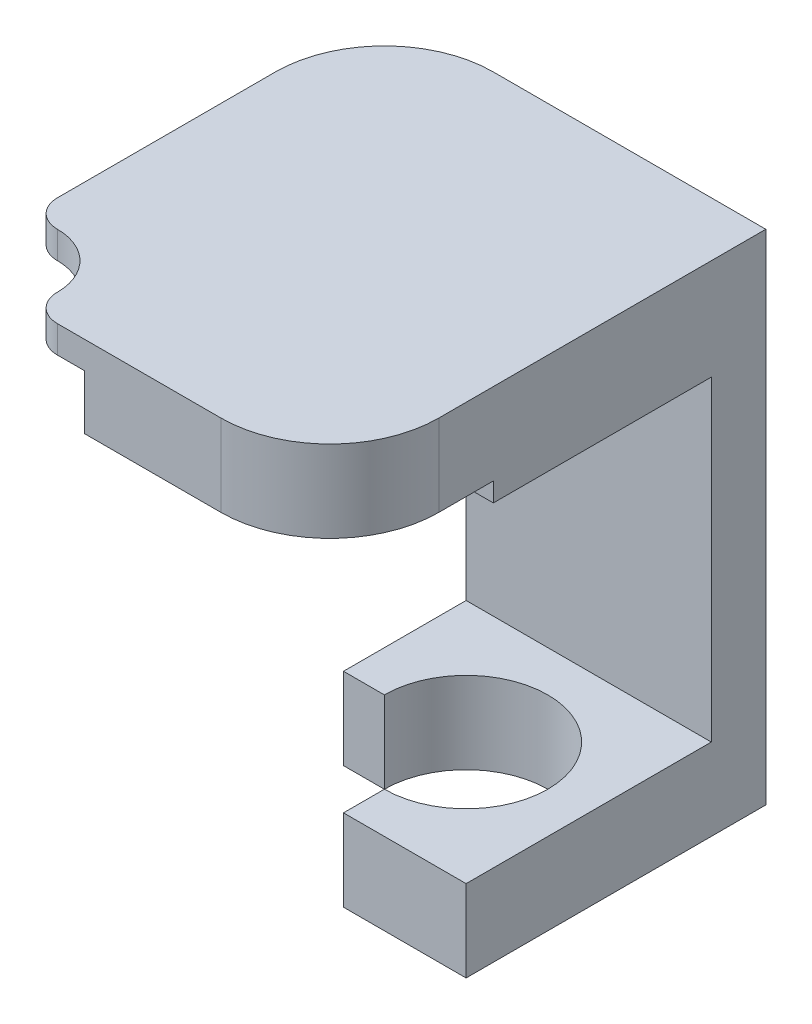
ISO-10303-21;
HEADER;
FILE_DESCRIPTION(('STEP AP214'),'2;1');
FILE_NAME('part.step','',(''),(''),'','','');
FILE_SCHEMA(('AUTOMOTIVE_DESIGN { 1 0 10303 214 1 1 1 1 }'));
ENDSEC;
DATA;
#1=APPLICATION_CONTEXT('core data for automotive mechanical design processes');
#2=APPLICATION_PROTOCOL_DEFINITION('international standard','automotive_design',2000,#1);
#3=PRODUCT_CONTEXT('',#1,'mechanical');
#4=PRODUCT('Part','Part','',(#3));
#5=PRODUCT_RELATED_PRODUCT_CATEGORY('part','',(#4));
#6=PRODUCT_DEFINITION_FORMATION('','',#4);
#7=PRODUCT_DEFINITION_CONTEXT('part definition',#1,'design');
#8=PRODUCT_DEFINITION('design','',#6,#7);
#9=PRODUCT_DEFINITION_SHAPE('','',#8);
#10=(LENGTH_UNIT() NAMED_UNIT(*) SI_UNIT(.MILLI.,.METRE.));
#11=(NAMED_UNIT(*) PLANE_ANGLE_UNIT() SI_UNIT($,.RADIAN.));
#12=(NAMED_UNIT(*) SI_UNIT($,.STERADIAN.) SOLID_ANGLE_UNIT());
#13=UNCERTAINTY_MEASURE_WITH_UNIT(LENGTH_MEASURE(1.E-05),#10,'distance_accuracy_value','');
#14=(GEOMETRIC_REPRESENTATION_CONTEXT(3) GLOBAL_UNCERTAINTY_ASSIGNED_CONTEXT((#13)) GLOBAL_UNIT_ASSIGNED_CONTEXT((#10,
#11,#12)) REPRESENTATION_CONTEXT('',''));
#15=CARTESIAN_POINT('',(0.,0.,0.));
#16=DIRECTION('',(0.,0.,1.));
#17=DIRECTION('',(1.,0.,0.));
#18=AXIS2_PLACEMENT_3D('',#15,#16,#17);
#19=CARTESIAN_POINT('',(0.,0.,5.28410471378163));
#20=DIRECTION('',(0.,0.,1.));
#21=DIRECTION('',(-1.,0.,0.));
#22=AXIS2_PLACEMENT_3D('',#19,#20,#21);
#23=PLANE('',#22);
#24=DIRECTION('',(0.,-1.,0.));
#25=VECTOR('',#24,1.);
#26=CARTESIAN_POINT('',(-13.3528439453228,-3.,5.28410471378163));
#27=LINE('',#26,#25);
#28=CARTESIAN_POINT('',(-13.3528439453228,11.5999999999993,5.28410471378163));
#29=VERTEX_POINT('',#28);
#30=CARTESIAN_POINT('',(-13.3528439453228,0.,5.28410471378163));
#31=VERTEX_POINT('',#30);
#32=EDGE_CURVE('E234',#29,#31,#27,.T.);
#33=ORIENTED_EDGE('',*,*,#32,.T.);
#34=DIRECTION('',(1.,0.,0.));
#35=VECTOR('',#34,1.);
#36=CARTESIAN_POINT('',(-13.3528439453228,0.,5.28410471378163));
#37=LINE('',#36,#35);
#38=CARTESIAN_POINT('',(-4.35284394532278,0.,5.28410471378163));
#39=VERTEX_POINT('',#38);
#40=EDGE_CURVE('E450',#31,#39,#37,.T.);
#41=ORIENTED_EDGE('',*,*,#40,.T.);
#42=DIRECTION('',(0.,1.,0.));
#43=VECTOR('',#42,1.);
#44=CARTESIAN_POINT('',(-4.35284394532278,-3.,5.28410471378163));
#45=LINE('',#44,#43);
#46=CARTESIAN_POINT('',(-4.35284394532278,11.5999999999993,5.28410471378163));
#47=VERTEX_POINT('',#46);
#48=EDGE_CURVE('E239',#39,#47,#45,.T.);
#49=ORIENTED_EDGE('',*,*,#48,.T.);
#50=DIRECTION('',(-1.,0.,0.));
#51=VECTOR('',#50,1.);
#52=CARTESIAN_POINT('',(-4.35284394532278,11.5999999999993,5.28410471378163));
#53=LINE('',#52,#51);
#54=EDGE_CURVE('E209',#47,#29,#53,.T.);
#55=ORIENTED_EDGE('',*,*,#54,.T.);
#56=EDGE_LOOP('',(#33,#41,#49,#55));
#57=FACE_BOUND('',#56,.T.);
#58=ADVANCED_FACE('F35',(#57),#23,.T.);
#59=CARTESIAN_POINT('',(-4.35284394532278,-3.,14.2841047137816));
#60=DIRECTION('',(1.,0.,0.));
#61=DIRECTION('',(0.,0.,1.));
#62=AXIS2_PLACEMENT_3D('',#59,#60,#61);
#63=PLANE('',#62);
#64=DIRECTION('',(0.,0.,1.));
#65=VECTOR('',#64,1.);
#66=CARTESIAN_POINT('',(-4.35284394532278,12.3,19.2841047137816));
#67=LINE('',#66,#65);
#68=CARTESIAN_POINT('',(-4.35284394532278,12.3,13.2841047137816));
#69=VERTEX_POINT('',#68);
#70=CARTESIAN_POINT('',(-4.35284394532278,12.3,15.2841047137816));
#71=VERTEX_POINT('',#70);
#72=EDGE_CURVE('E321',#69,#71,#67,.T.);
#73=ORIENTED_EDGE('',*,*,#72,.F.);
#74=DIRECTION('',(0.,-1.,0.));
#75=VECTOR('',#74,1.);
#76=CARTESIAN_POINT('',(-4.35284394532278,15.3,13.2841047137816));
#77=LINE('',#76,#75);
#78=CARTESIAN_POINT('',(-4.35284394532278,11.5999999999993,13.2841047137816));
#79=VERTEX_POINT('',#78);
#80=EDGE_CURVE('E220',#69,#79,#77,.T.);
#81=ORIENTED_EDGE('',*,*,#80,.T.);
#82=DIRECTION('',(0.,0.,-1.));
#83=VECTOR('',#82,1.);
#84=CARTESIAN_POINT('',(-4.35284394532278,11.5999999999993,13.2841047137816));
#85=LINE('',#84,#83);
#86=EDGE_CURVE('E232',#79,#47,#85,.T.);
#87=ORIENTED_EDGE('',*,*,#86,.T.);
#88=ORIENTED_EDGE('',*,*,#48,.F.);
#89=DIRECTION('',(0.,0.,1.));
#90=VECTOR('',#89,1.);
#91=CARTESIAN_POINT('',(-4.35284394532278,0.,14.2841047137816));
#92=LINE('',#91,#90);
#93=CARTESIAN_POINT('',(-4.35284394532278,0.,14.2841047137816));
#94=VERTEX_POINT('',#93);
#95=EDGE_CURVE('E473',#39,#94,#92,.T.);
#96=ORIENTED_EDGE('',*,*,#95,.T.);
#97=DIRECTION('',(0.,1.,0.));
#98=VECTOR('',#97,1.);
#99=CARTESIAN_POINT('',(-4.35284394532278,-3.,14.2841047137816));
#100=LINE('',#99,#98);
#101=CARTESIAN_POINT('',(-4.35284394532278,-3.,14.2841047137816));
#102=VERTEX_POINT('',#101);
#103=EDGE_CURVE('E261',#102,#94,#100,.T.);
#104=ORIENTED_EDGE('',*,*,#103,.F.);
#105=DIRECTION('',(0.,0.,1.));
#106=VECTOR('',#105,1.);
#107=CARTESIAN_POINT('',(-4.35284394532278,-3.,14.2841047137816));
#108=LINE('',#107,#106);
#109=CARTESIAN_POINT('',(-4.35284394532278,-3.,3.28410471378163));
#110=VERTEX_POINT('',#109);
#111=EDGE_CURVE('E481',#110,#102,#108,.T.);
#112=ORIENTED_EDGE('',*,*,#111,.F.);
#113=DIRECTION('',(0.,1.,0.));
#114=VECTOR('',#113,1.);
#115=CARTESIAN_POINT('',(-4.35284394532278,-3.,3.28410471378163));
#116=LINE('',#115,#114);
#117=CARTESIAN_POINT('',(-4.35284394532278,15.3,3.28410471378163));
#118=VERTEX_POINT('',#117);
#119=EDGE_CURVE('E241',#110,#118,#116,.T.);
#120=ORIENTED_EDGE('',*,*,#119,.T.);
#121=DIRECTION('',(0.,0.,1.));
#122=VECTOR('',#121,1.);
#123=CARTESIAN_POINT('',(-4.35284394532278,15.3,3.28410471378163));
#124=LINE('',#123,#122);
#125=CARTESIAN_POINT('',(-4.35284394532278,15.3,15.2841047137816));
#126=VERTEX_POINT('',#125);
#127=EDGE_CURVE('E247',#118,#126,#124,.T.);
#128=ORIENTED_EDGE('',*,*,#127,.T.);
#129=DIRECTION('',(0.,1.,0.));
#130=VECTOR('',#129,1.);
#131=CARTESIAN_POINT('',(-4.35284394532278,-3.,15.2841047137816));
#132=LINE('',#131,#130);
#133=EDGE_CURVE('E260',#71,#126,#132,.T.);
#134=ORIENTED_EDGE('',*,*,#133,.F.);
#135=EDGE_LOOP('',(#73,#81,#87,#88,#96,#104,#112,#120,#128,#134));
#136=FACE_BOUND('',#135,.T.);
#137=ADVANCED_FACE('F357',(#136),#63,.T.);
#138=CARTESIAN_POINT('',(-13.3528439453228,-3.,14.2841047137816));
#139=DIRECTION('',(-1.,0.,0.));
#140=DIRECTION('',(0.,0.,-1.));
#141=AXIS2_PLACEMENT_3D('',#138,#139,#140);
#142=PLANE('',#141);
#143=DIRECTION('',(0.,0.,-1.));
#144=VECTOR('',#143,1.);
#145=CARTESIAN_POINT('',(-13.3528439453228,12.3,14.2841047137816));
#146=LINE('',#145,#144);
#147=CARTESIAN_POINT('',(-13.3528439453228,12.3,13.2841047137816));
#148=VERTEX_POINT('',#147);
#149=CARTESIAN_POINT('',(-13.3528439453228,12.3,3.28410471378163));
#150=VERTEX_POINT('',#149);
#151=EDGE_CURVE('E206',#148,#150,#146,.T.);
#152=ORIENTED_EDGE('',*,*,#151,.T.);
#153=DIRECTION('',(0.,-1.,0.));
#154=VECTOR('',#153,1.);
#155=CARTESIAN_POINT('',(-13.3528439453228,-3.,3.28410471378163));
#156=LINE('',#155,#154);
#157=CARTESIAN_POINT('',(-13.3528439453228,-3.,3.28410471378163));
#158=VERTEX_POINT('',#157);
#159=EDGE_CURVE('E235',#150,#158,#156,.T.);
#160=ORIENTED_EDGE('',*,*,#159,.T.);
#161=DIRECTION('',(0.,0.,-1.));
#162=VECTOR('',#161,1.);
#163=CARTESIAN_POINT('',(-13.3528439453228,-3.,14.2841047137816));
#164=LINE('',#163,#162);
#165=CARTESIAN_POINT('',(-13.3528439453228,-3.,9.78410471378163));
#166=VERTEX_POINT('',#165);
#167=EDGE_CURVE('E487',#166,#158,#164,.T.);
#168=ORIENTED_EDGE('',*,*,#167,.F.);
#169=DIRECTION('',(0.,-1.,0.));
#170=VECTOR('',#169,1.);
#171=CARTESIAN_POINT('',(-13.3528439453228,0.,9.78410471378163));
#172=LINE('',#171,#170);
#173=CARTESIAN_POINT('',(-13.3528439453228,0.,9.78410471378163));
#174=VERTEX_POINT('',#173);
#175=EDGE_CURVE('E477',#174,#166,#172,.T.);
#176=ORIENTED_EDGE('',*,*,#175,.F.);
#177=DIRECTION('',(0.,0.,-1.));
#178=VECTOR('',#177,1.);
#179=CARTESIAN_POINT('',(-13.3528439453228,0.,14.2841047137816));
#180=LINE('',#179,#178);
#181=EDGE_CURVE('E493',#174,#31,#180,.T.);
#182=ORIENTED_EDGE('',*,*,#181,.T.);
#183=ORIENTED_EDGE('',*,*,#32,.F.);
#184=DIRECTION('',(0.,0.,-1.));
#185=VECTOR('',#184,1.);
#186=CARTESIAN_POINT('',(-13.3528439453228,11.5999999999993,13.2841047137816));
#187=LINE('',#186,#185);
#188=CARTESIAN_POINT('',(-13.3528439453228,11.5999999999993,13.2841047137816));
#189=VERTEX_POINT('',#188);
#190=EDGE_CURVE('E228',#189,#29,#187,.T.);
#191=ORIENTED_EDGE('',*,*,#190,.F.);
#192=DIRECTION('',(0.,-1.,0.));
#193=VECTOR('',#192,1.);
#194=CARTESIAN_POINT('',(-13.3528439453228,15.3,13.2841047137816));
#195=LINE('',#194,#193);
#196=EDGE_CURVE('E225',#148,#189,#195,.T.);
#197=ORIENTED_EDGE('',*,*,#196,.F.);
#198=EDGE_LOOP('',(#152,#160,#168,#176,#182,#183,#191,#197));
#199=FACE_BOUND('',#198,.T.);
#200=ADVANCED_FACE('F363',(#199),#142,.T.);
#201=CARTESIAN_POINT('',(-13.3528439453228,-3.,14.2841047137816));
#202=DIRECTION('',(0.,0.,1.));
#203=DIRECTION('',(-1.,0.,0.));
#204=AXIS2_PLACEMENT_3D('',#201,#202,#203);
#205=PLANE('',#204);
#206=DIRECTION('',(0.,-1.,0.));
#207=VECTOR('',#206,1.);
#208=CARTESIAN_POINT('',(-8.85284394532278,0.,14.2841047137816));
#209=LINE('',#208,#207);
#210=CARTESIAN_POINT('',(-8.85284394532278,0.,14.2841047137816));
#211=VERTEX_POINT('',#210);
#212=CARTESIAN_POINT('',(-8.85284394532278,-3.,14.2841047137816));
#213=VERTEX_POINT('',#212);
#214=EDGE_CURVE('E474',#211,#213,#209,.T.);
#215=ORIENTED_EDGE('',*,*,#214,.T.);
#216=DIRECTION('',(-1.,0.,0.));
#217=VECTOR('',#216,1.);
#218=CARTESIAN_POINT('',(-13.3528439453228,-3.,14.2841047137816));
#219=LINE('',#218,#217);
#220=EDGE_CURVE('E484',#102,#213,#219,.T.);
#221=ORIENTED_EDGE('',*,*,#220,.F.);
#222=ORIENTED_EDGE('',*,*,#103,.T.);
#223=DIRECTION('',(-1.,0.,0.));
#224=VECTOR('',#223,1.);
#225=CARTESIAN_POINT('',(-13.3528439453228,0.,14.2841047137816));
#226=LINE('',#225,#224);
#227=EDGE_CURVE('E490',#94,#211,#226,.T.);
#228=ORIENTED_EDGE('',*,*,#227,.T.);
#229=EDGE_LOOP('',(#215,#221,#222,#228));
#230=FACE_BOUND('',#229,.T.);
#231=ADVANCED_FACE('F388',(#230),#205,.T.);
#232=CARTESIAN_POINT('',(0.,-3.,0.));
#233=DIRECTION('',(0.,1.,0.));
#234=DIRECTION('',(0.,0.,-1.));
#235=AXIS2_PLACEMENT_3D('',#232,#233,#234);
#236=PLANE('',#235);
#237=CARTESIAN_POINT('',(-8.85284394532278,-3.,9.78410471378163));
#238=DIRECTION('',(0.,1.,0.));
#239=DIRECTION('',(0.,0.,1.));
#240=AXIS2_PLACEMENT_3D('',#237,#238,#239);
#241=CIRCLE('',#240,3.);
#242=CARTESIAN_POINT('',(-8.85284394532278,-3.,12.7841047137816));
#243=VERTEX_POINT('',#242);
#244=CARTESIAN_POINT('',(-11.8528439453228,-3.,9.78410471378163));
#245=VERTEX_POINT('',#244);
#246=EDGE_CURVE('E464',#243,#245,#241,.T.);
#247=ORIENTED_EDGE('',*,*,#246,.T.);
#248=DIRECTION('',(-1.,0.,0.));
#249=VECTOR('',#248,1.);
#250=CARTESIAN_POINT('',(-13.3528439453228,-3.,9.78410471378163));
#251=LINE('',#250,#249);
#252=EDGE_CURVE('E467',#245,#166,#251,.T.);
#253=ORIENTED_EDGE('',*,*,#252,.T.);
#254=ORIENTED_EDGE('',*,*,#167,.T.);
#255=DIRECTION('',(1.,0.,0.));
#256=VECTOR('',#255,1.);
#257=CARTESIAN_POINT('',(-13.3528439453228,-3.,3.28410471378163));
#258=LINE('',#257,#256);
#259=EDGE_CURVE('E238',#158,#110,#258,.T.);
#260=ORIENTED_EDGE('',*,*,#259,.T.);
#261=ORIENTED_EDGE('',*,*,#111,.T.);
#262=ORIENTED_EDGE('',*,*,#220,.T.);
#263=DIRECTION('',(0.,0.,-1.));
#264=VECTOR('',#263,1.);
#265=CARTESIAN_POINT('',(-8.85284394532278,-3.,12.7841047137816));
#266=LINE('',#265,#264);
#267=EDGE_CURVE('E458',#213,#243,#266,.T.);
#268=ORIENTED_EDGE('',*,*,#267,.T.);
#269=EDGE_LOOP('',(#247,#253,#254,#260,#261,#262,#268));
#270=FACE_BOUND('',#269,.T.);
#271=ADVANCED_FACE('F385',(#270),#236,.F.);
#272=CARTESIAN_POINT('',(0.,0.,0.));
#273=DIRECTION('',(0.,1.,0.));
#274=DIRECTION('',(0.,0.,-1.));
#275=AXIS2_PLACEMENT_3D('',#272,#273,#274);
#276=PLANE('',#275);
#277=DIRECTION('',(0.,0.,-1.));
#278=VECTOR('',#277,1.);
#279=CARTESIAN_POINT('',(-8.85284394532278,0.,12.7841047137816));
#280=LINE('',#279,#278);
#281=CARTESIAN_POINT('',(-8.85284394532278,0.,12.7841047137816));
#282=VERTEX_POINT('',#281);
#283=EDGE_CURVE('E460',#211,#282,#280,.T.);
#284=ORIENTED_EDGE('',*,*,#283,.F.);
#285=ORIENTED_EDGE('',*,*,#227,.F.);
#286=ORIENTED_EDGE('',*,*,#95,.F.);
#287=ORIENTED_EDGE('',*,*,#40,.F.);
#288=ORIENTED_EDGE('',*,*,#181,.F.);
#289=DIRECTION('',(-1.,0.,0.));
#290=VECTOR('',#289,1.);
#291=CARTESIAN_POINT('',(-13.3528439453228,0.,9.78410471378163));
#292=LINE('',#291,#290);
#293=CARTESIAN_POINT('',(-11.8528439453228,0.,9.78410471378163));
#294=VERTEX_POINT('',#293);
#295=EDGE_CURVE('E457',#294,#174,#292,.T.);
#296=ORIENTED_EDGE('',*,*,#295,.F.);
#297=CARTESIAN_POINT('',(-8.85284394532278,0.,9.78410471378163));
#298=DIRECTION('',(0.,1.,0.));
#299=DIRECTION('',(0.,0.,1.));
#300=AXIS2_PLACEMENT_3D('',#297,#298,#299);
#301=CIRCLE('',#300,3.);
#302=EDGE_CURVE('E454',#282,#294,#301,.T.);
#303=ORIENTED_EDGE('',*,*,#302,.F.);
#304=EDGE_LOOP('',(#284,#285,#286,#287,#288,#296,#303));
#305=FACE_BOUND('',#304,.T.);
#306=ADVANCED_FACE('F383',(#305),#276,.T.);
#307=CARTESIAN_POINT('',(-8.85284394532278,0.,9.78410471378163));
#308=DIRECTION('',(0.,-1.,0.));
#309=DIRECTION('',(0.,0.,1.));
#310=AXIS2_PLACEMENT_3D('',#307,#308,#309);
#311=CYLINDRICAL_SURFACE('',#310,3.);
#312=ORIENTED_EDGE('',*,*,#246,.F.);
#313=DIRECTION('',(0.,-1.,0.));
#314=VECTOR('',#313,1.);
#315=CARTESIAN_POINT('',(-8.85284394532278,0.,12.7841047137816));
#316=LINE('',#315,#314);
#317=EDGE_CURVE('E471',#282,#243,#316,.T.);
#318=ORIENTED_EDGE('',*,*,#317,.F.);
#319=ORIENTED_EDGE('',*,*,#302,.T.);
#320=DIRECTION('',(0.,-1.,0.));
#321=VECTOR('',#320,1.);
#322=CARTESIAN_POINT('',(-11.8528439453228,0.,9.78410471378163));
#323=LINE('',#322,#321);
#324=EDGE_CURVE('E463',#294,#245,#323,.T.);
#325=ORIENTED_EDGE('',*,*,#324,.T.);
#326=EDGE_LOOP('',(#312,#318,#319,#325));
#327=FACE_BOUND('',#326,.T.);
#328=ADVANCED_FACE('F376',(#327),#311,.F.);
#329=CARTESIAN_POINT('',(-8.85284394532278,0.,12.7841047137816));
#330=DIRECTION('',(1.,0.,0.));
#331=DIRECTION('',(0.,0.,1.));
#332=AXIS2_PLACEMENT_3D('',#329,#330,#331);
#333=PLANE('',#332);
#334=ORIENTED_EDGE('',*,*,#267,.F.);
#335=ORIENTED_EDGE('',*,*,#214,.F.);
#336=ORIENTED_EDGE('',*,*,#283,.T.);
#337=ORIENTED_EDGE('',*,*,#317,.T.);
#338=EDGE_LOOP('',(#334,#335,#336,#337));
#339=FACE_BOUND('',#338,.T.);
#340=ADVANCED_FACE('F373',(#339),#333,.F.);
#341=CARTESIAN_POINT('',(-13.3528439453228,0.,9.78410471378163));
#342=DIRECTION('',(0.,0.,-1.));
#343=DIRECTION('',(1.,0.,0.));
#344=AXIS2_PLACEMENT_3D('',#341,#342,#343);
#345=PLANE('',#344);
#346=ORIENTED_EDGE('',*,*,#252,.F.);
#347=ORIENTED_EDGE('',*,*,#324,.F.);
#348=ORIENTED_EDGE('',*,*,#295,.T.);
#349=ORIENTED_EDGE('',*,*,#175,.T.);
#350=EDGE_LOOP('',(#346,#347,#348,#349));
#351=FACE_BOUND('',#350,.T.);
#352=ADVANCED_FACE('F372',(#351),#345,.F.);
#353=CARTESIAN_POINT('',(-13.3528439453228,15.3,3.28410471378163));
#354=DIRECTION('',(0.,-1.,0.));
#355=DIRECTION('',(0.,0.,1.));
#356=AXIS2_PLACEMENT_3D('',#353,#354,#355);
#357=PLANE('',#356);
#358=DIRECTION('',(-1.,0.,0.));
#359=VECTOR('',#358,1.);
#360=CARTESIAN_POINT('',(-13.3528439453207,15.3,19.2841047137816));
#361=LINE('',#360,#359);
#362=CARTESIAN_POINT('',(-8.35284394532278,15.3,19.2841047137816));
#363=VERTEX_POINT('',#362);
#364=CARTESIAN_POINT('',(-14.3528439453207,15.3,19.2841047137816));
#365=VERTEX_POINT('',#364);
#366=EDGE_CURVE('E214',#363,#365,#361,.T.);
#367=ORIENTED_EDGE('',*,*,#366,.F.);
#368=CARTESIAN_POINT('',(-8.35284394532278,15.3,15.2841047137816));
#369=DIRECTION('',(0.,1.,0.));
#370=DIRECTION('',(0.,0.,1.));
#371=AXIS2_PLACEMENT_3D('',#368,#369,#370);
#372=CIRCLE('',#371,4.);
#373=EDGE_CURVE('E267',#126,#363,#372,.F.);
#374=ORIENTED_EDGE('',*,*,#373,.F.);
#375=ORIENTED_EDGE('',*,*,#127,.F.);
#376=DIRECTION('',(-1.,0.,0.));
#377=VECTOR('',#376,1.);
#378=CARTESIAN_POINT('',(-13.3528439453228,15.3,3.28410471378163));
#379=LINE('',#378,#377);
#380=CARTESIAN_POINT('',(-14.3528439453228,15.3,3.28410471378163));
#381=VERTEX_POINT('',#380);
#382=EDGE_CURVE('E244',#118,#381,#379,.T.);
#383=ORIENTED_EDGE('',*,*,#382,.T.);
#384=CARTESIAN_POINT('',(-14.3528439453228,15.3,7.28410471378163));
#385=DIRECTION('',(0.,1.,0.));
#386=DIRECTION('',(0.,0.,1.));
#387=AXIS2_PLACEMENT_3D('',#384,#385,#386);
#388=CIRCLE('',#387,4.);
#389=CARTESIAN_POINT('',(-18.3528439453228,15.3,7.28410471378163));
#390=VERTEX_POINT('',#389);
#391=EDGE_CURVE('E264',#390,#381,#388,.F.);
#392=ORIENTED_EDGE('',*,*,#391,.F.);
#393=DIRECTION('',(0.,0.,-1.));
#394=VECTOR('',#393,1.);
#395=CARTESIAN_POINT('',(-18.3528439453228,15.3,3.28410471378163));
#396=LINE('',#395,#394);
#397=CARTESIAN_POINT('',(-18.3528439453228,15.3,15.2841047137844));
#398=VERTEX_POINT('',#397);
#399=EDGE_CURVE('E195',#398,#390,#396,.T.);
#400=ORIENTED_EDGE('',*,*,#399,.F.);
#401=CARTESIAN_POINT('',(-17.3528439453228,15.3,15.2841047137844));
#402=DIRECTION('',(0.,1.,0.));
#403=DIRECTION('',(0.,0.,1.));
#404=AXIS2_PLACEMENT_3D('',#401,#402,#403);
#405=CIRCLE('',#404,1.);
#406=CARTESIAN_POINT('',(-17.3528439453207,15.3,16.2841047137844));
#407=VERTEX_POINT('',#406);
#408=EDGE_CURVE('E294',#407,#398,#405,.F.);
#409=ORIENTED_EDGE('',*,*,#408,.F.);
#410=CARTESIAN_POINT('',(-17.3528439453207,15.3,18.2841047137844));
#411=DIRECTION('',(0.,1.,0.));
#412=DIRECTION('',(0.,0.,1.));
#413=AXIS2_PLACEMENT_3D('',#410,#411,#412);
#414=CIRCLE('',#413,2.);
#415=CARTESIAN_POINT('',(-15.3528439453207,15.3,18.2841047137844));
#416=VERTEX_POINT('',#415);
#417=EDGE_CURVE('E286',#416,#407,#414,.T.);
#418=ORIENTED_EDGE('',*,*,#417,.F.);
#419=CARTESIAN_POINT('',(-14.3528439453207,15.3,18.2841047137816));
#420=DIRECTION('',(0.,1.,0.));
#421=DIRECTION('',(0.,0.,1.));
#422=AXIS2_PLACEMENT_3D('',#419,#420,#421);
#423=CIRCLE('',#422,1.);
#424=EDGE_CURVE('E296',#365,#416,#423,.F.);
#425=ORIENTED_EDGE('',*,*,#424,.F.);
#426=EDGE_LOOP('',(#367,#374,#375,#383,#392,#400,#409,#418,#425));
#427=FACE_BOUND('',#426,.T.);
#428=ADVANCED_FACE('F332',(#427),#357,.F.);
#429=CARTESIAN_POINT('',(0.,0.,3.28410471378163));
#430=DIRECTION('',(0.,0.,1.));
#431=DIRECTION('',(-1.,0.,0.));
#432=AXIS2_PLACEMENT_3D('',#429,#430,#431);
#433=PLANE('',#432);
#434=ORIENTED_EDGE('',*,*,#382,.F.);
#435=ORIENTED_EDGE('',*,*,#119,.F.);
#436=ORIENTED_EDGE('',*,*,#259,.F.);
#437=ORIENTED_EDGE('',*,*,#159,.F.);
#438=DIRECTION('',(1.,0.,0.));
#439=VECTOR('',#438,1.);
#440=CARTESIAN_POINT('',(-18.3528439453228,12.3,3.28410471378163));
#441=LINE('',#440,#439);
#442=CARTESIAN_POINT('',(-14.3528439453228,12.3,3.28410471378163));
#443=VERTEX_POINT('',#442);
#444=EDGE_CURVE('E319',#443,#150,#441,.T.);
#445=ORIENTED_EDGE('',*,*,#444,.F.);
#446=DIRECTION('',(0.,1.,0.));
#447=VECTOR('',#446,1.);
#448=CARTESIAN_POINT('',(-14.3528439453228,12.3,3.28410471378163));
#449=LINE('',#448,#447);
#450=EDGE_CURVE('E279',#381,#443,#449,.F.);
#451=ORIENTED_EDGE('',*,*,#450,.F.);
#452=EDGE_LOOP('',(#434,#435,#436,#437,#445,#451));
#453=FACE_BOUND('',#452,.T.);
#454=ADVANCED_FACE('F368',(#453),#433,.F.);
#455=CARTESIAN_POINT('',(-4.35284394532278,11.5999999999993,13.2841047137816));
#456=DIRECTION('',(0.,1.,0.));
#457=DIRECTION('',(0.,0.,-1.));
#458=AXIS2_PLACEMENT_3D('',#455,#456,#457);
#459=PLANE('',#458);
#460=CARTESIAN_POINT('',(-8.85284394532278,11.5999999999993,9.78410471378163));
#461=DIRECTION('',(0.,1.,0.));
#462=DIRECTION('',(0.,0.,1.));
#463=AXIS2_PLACEMENT_3D('',#460,#461,#462);
#464=CIRCLE('',#463,1.32996856805454);
#465=CARTESIAN_POINT('',(-8.85284394532278,11.5999999999993,11.1140732818362));
#466=VERTEX_POINT('',#465);
#467=EDGE_CURVE('E313',#466,#466,#464,.T.);
#468=ORIENTED_EDGE('',*,*,#467,.T.);
#469=EDGE_LOOP('',(#468));
#470=FACE_BOUND('',#469,.T.);
#471=ORIENTED_EDGE('',*,*,#54,.F.);
#472=ORIENTED_EDGE('',*,*,#86,.F.);
#473=DIRECTION('',(-1.,0.,0.));
#474=VECTOR('',#473,1.);
#475=CARTESIAN_POINT('',(-4.35284394532278,11.5999999999993,13.2841047137816));
#476=LINE('',#475,#474);
#477=EDGE_CURVE('E223',#79,#189,#476,.T.);
#478=ORIENTED_EDGE('',*,*,#477,.T.);
#479=ORIENTED_EDGE('',*,*,#190,.T.);
#480=EDGE_LOOP('',(#471,#472,#478,#479));
#481=FACE_BOUND('',#480,.T.);
#482=ADVANCED_FACE('F431',(#470,#481),#459,.F.);
#483=CARTESIAN_POINT('',(0.,0.,13.2841047137816));
#484=DIRECTION('',(0.,0.,1.));
#485=DIRECTION('',(-1.,0.,0.));
#486=AXIS2_PLACEMENT_3D('',#483,#484,#485);
#487=PLANE('',#486);
#488=DIRECTION('',(-1.,0.,0.));
#489=VECTOR('',#488,1.);
#490=CARTESIAN_POINT('',(0.,12.3,13.2841047137816));
#491=LINE('',#490,#489);
#492=EDGE_CURVE('E258',#69,#148,#491,.T.);
#493=ORIENTED_EDGE('',*,*,#492,.T.);
#494=ORIENTED_EDGE('',*,*,#196,.T.);
#495=ORIENTED_EDGE('',*,*,#477,.F.);
#496=ORIENTED_EDGE('',*,*,#80,.F.);
#497=EDGE_LOOP('',(#493,#494,#495,#496));
#498=FACE_BOUND('',#497,.T.);
#499=ADVANCED_FACE('F429',(#498),#487,.T.);
#500=CARTESIAN_POINT('',(-18.3528439453228,12.3,3.28410471378163));
#501=DIRECTION('',(-1.,0.,0.));
#502=DIRECTION('',(0.,0.,-1.));
#503=AXIS2_PLACEMENT_3D('',#500,#501,#502);
#504=PLANE('',#503);
#505=ORIENTED_EDGE('',*,*,#399,.T.);
#506=DIRECTION('',(0.,1.,0.));
#507=VECTOR('',#506,1.);
#508=CARTESIAN_POINT('',(-18.3528439453228,15.3,7.28410471378163));
#509=LINE('',#508,#507);
#510=CARTESIAN_POINT('',(-18.3528439453228,12.3,7.28410471378163));
#511=VERTEX_POINT('',#510);
#512=EDGE_CURVE('E277',#511,#390,#509,.T.);
#513=ORIENTED_EDGE('',*,*,#512,.F.);
#514=DIRECTION('',(0.,0.,-1.));
#515=VECTOR('',#514,1.);
#516=CARTESIAN_POINT('',(-18.3528439453228,12.3,3.28410471378163));
#517=LINE('',#516,#515);
#518=CARTESIAN_POINT('',(-18.3528439453228,12.3,14.2841047137844));
#519=VERTEX_POINT('',#518);
#520=EDGE_CURVE('E205',#519,#511,#517,.T.);
#521=ORIENTED_EDGE('',*,*,#520,.F.);
#522=DIRECTION('',(0.,1.,0.));
#523=VECTOR('',#522,1.);
#524=CARTESIAN_POINT('',(-18.3528439453228,12.3,14.2841047137844));
#525=LINE('',#524,#523);
#526=CARTESIAN_POINT('',(-18.3528439453228,14.3,14.2841047137844));
#527=VERTEX_POINT('',#526);
#528=EDGE_CURVE('E190',#519,#527,#525,.T.);
#529=ORIENTED_EDGE('',*,*,#528,.T.);
#530=DIRECTION('',(0.,0.,-1.));
#531=VECTOR('',#530,1.);
#532=CARTESIAN_POINT('',(-18.3528439453228,14.3,16.2841047137844));
#533=LINE('',#532,#531);
#534=CARTESIAN_POINT('',(-18.3528439453228,14.3,15.2841047137844));
#535=VERTEX_POINT('',#534);
#536=EDGE_CURVE('E198',#535,#527,#533,.T.);
#537=ORIENTED_EDGE('',*,*,#536,.F.);
#538=DIRECTION('',(0.,1.,0.));
#539=VECTOR('',#538,1.);
#540=CARTESIAN_POINT('',(-18.3528439453228,12.3,15.2841047137844));
#541=LINE('',#540,#539);
#542=EDGE_CURVE('E11',#398,#535,#541,.F.);
#543=ORIENTED_EDGE('',*,*,#542,.F.);
#544=EDGE_LOOP('',(#505,#513,#521,#529,#537,#543));
#545=FACE_BOUND('',#544,.T.);
#546=ADVANCED_FACE('F202',(#545),#504,.T.);
#547=CARTESIAN_POINT('',(-18.3528439453228,12.3,14.2841047137844));
#548=DIRECTION('',(0.,0.,1.));
#549=DIRECTION('',(-1.,0.,0.));
#550=AXIS2_PLACEMENT_3D('',#547,#548,#549);
#551=PLANE('',#550);
#552=DIRECTION('',(-1.,0.,0.));
#553=VECTOR('',#552,1.);
#554=CARTESIAN_POINT('',(-18.3528439453228,14.3,14.2841047137844));
#555=LINE('',#554,#553);
#556=CARTESIAN_POINT('',(-13.3528439453207,14.3,14.2841047137844));
#557=VERTEX_POINT('',#556);
#558=EDGE_CURVE('E186',#557,#527,#555,.T.);
#559=ORIENTED_EDGE('',*,*,#558,.T.);
#560=ORIENTED_EDGE('',*,*,#528,.F.);
#561=DIRECTION('',(-1.,0.,0.));
#562=VECTOR('',#561,1.);
#563=CARTESIAN_POINT('',(-18.3528439453228,12.3,14.2841047137844));
#564=LINE('',#563,#562);
#565=CARTESIAN_POINT('',(-13.3528439453207,12.3,14.2841047137844));
#566=VERTEX_POINT('',#565);
#567=EDGE_CURVE('E218',#566,#519,#564,.T.);
#568=ORIENTED_EDGE('',*,*,#567,.F.);
#569=DIRECTION('',(0.,1.,0.));
#570=VECTOR('',#569,1.);
#571=CARTESIAN_POINT('',(-13.3528439453207,12.3,14.2841047137844));
#572=LINE('',#571,#570);
#573=EDGE_CURVE('E193',#566,#557,#572,.T.);
#574=ORIENTED_EDGE('',*,*,#573,.T.);
#575=EDGE_LOOP('',(#559,#560,#568,#574));
#576=FACE_BOUND('',#575,.T.);
#577=ADVANCED_FACE('F187',(#576),#551,.T.);
#578=CARTESIAN_POINT('',(-13.3528439453207,12.3,14.2841047137844));
#579=DIRECTION('',(-1.,0.,0.));
#580=DIRECTION('',(0.,0.,-1.));
#581=AXIS2_PLACEMENT_3D('',#578,#579,#580);
#582=PLANE('',#581);
#583=DIRECTION('',(0.,0.,-1.));
#584=VECTOR('',#583,1.);
#585=CARTESIAN_POINT('',(-13.3528439453207,14.3,14.2841047137844));
#586=LINE('',#585,#584);
#587=CARTESIAN_POINT('',(-13.3528439453207,14.3,19.2841047137816));
#588=VERTEX_POINT('',#587);
#589=EDGE_CURVE('E196',#588,#557,#586,.T.);
#590=ORIENTED_EDGE('',*,*,#589,.T.);
#591=ORIENTED_EDGE('',*,*,#573,.F.);
#592=DIRECTION('',(0.,0.,-1.));
#593=VECTOR('',#592,1.);
#594=CARTESIAN_POINT('',(-13.3528439453207,12.3,14.2841047137844));
#595=LINE('',#594,#593);
#596=CARTESIAN_POINT('',(-13.3528439453207,12.3,19.2841047137816));
#597=VERTEX_POINT('',#596);
#598=EDGE_CURVE('E326',#597,#566,#595,.T.);
#599=ORIENTED_EDGE('',*,*,#598,.F.);
#600=DIRECTION('',(0.,1.,0.));
#601=VECTOR('',#600,1.);
#602=CARTESIAN_POINT('',(-13.3528439453207,12.3,19.2841047137816));
#603=LINE('',#602,#601);
#604=EDGE_CURVE('E211',#597,#588,#603,.T.);
#605=ORIENTED_EDGE('',*,*,#604,.T.);
#606=EDGE_LOOP('',(#590,#591,#599,#605));
#607=FACE_BOUND('',#606,.T.);
#608=ADVANCED_FACE('F342',(#607),#582,.T.);
#609=CARTESIAN_POINT('',(-13.3528439453207,12.3,19.2841047137816));
#610=DIRECTION('',(0.,0.,1.));
#611=DIRECTION('',(-1.,0.,0.));
#612=AXIS2_PLACEMENT_3D('',#609,#610,#611);
#613=PLANE('',#612);
#614=DIRECTION('',(-1.,0.,0.));
#615=VECTOR('',#614,1.);
#616=CARTESIAN_POINT('',(-4.35284394532278,14.3,19.2841047137816));
#617=LINE('',#616,#615);
#618=CARTESIAN_POINT('',(-14.3528439453207,14.3,19.2841047137816));
#619=VERTEX_POINT('',#618);
#620=EDGE_CURVE('E200',#588,#619,#617,.T.);
#621=ORIENTED_EDGE('',*,*,#620,.F.);
#622=ORIENTED_EDGE('',*,*,#604,.F.);
#623=DIRECTION('',(-1.,0.,0.));
#624=VECTOR('',#623,1.);
#625=CARTESIAN_POINT('',(-13.3528439453207,12.3,19.2841047137816));
#626=LINE('',#625,#624);
#627=CARTESIAN_POINT('',(-8.35284394532278,12.3,19.2841047137816));
#628=VERTEX_POINT('',#627);
#629=EDGE_CURVE('E324',#628,#597,#626,.T.);
#630=ORIENTED_EDGE('',*,*,#629,.F.);
#631=DIRECTION('',(0.,1.,0.));
#632=VECTOR('',#631,1.);
#633=CARTESIAN_POINT('',(-8.35284394532278,12.3,19.2841047137816));
#634=LINE('',#633,#632);
#635=EDGE_CURVE('E270',#363,#628,#634,.F.);
#636=ORIENTED_EDGE('',*,*,#635,.F.);
#637=ORIENTED_EDGE('',*,*,#366,.T.);
#638=DIRECTION('',(0.,1.,0.));
#639=VECTOR('',#638,1.);
#640=CARTESIAN_POINT('',(-14.3528439453207,12.3,19.2841047137816));
#641=LINE('',#640,#639);
#642=EDGE_CURVE('E292',#619,#365,#641,.T.);
#643=ORIENTED_EDGE('',*,*,#642,.F.);
#644=EDGE_LOOP('',(#621,#622,#630,#636,#637,#643));
#645=FACE_BOUND('',#644,.T.);
#646=ADVANCED_FACE('F307',(#645),#613,.T.);
#647=CARTESIAN_POINT('',(0.,12.3,0.));
#648=DIRECTION('',(0.,-1.,0.));
#649=DIRECTION('',(0.,0.,1.));
#650=AXIS2_PLACEMENT_3D('',#647,#648,#649);
#651=PLANE('',#650);
#652=ORIENTED_EDGE('',*,*,#629,.T.);
#653=ORIENTED_EDGE('',*,*,#598,.T.);
#654=ORIENTED_EDGE('',*,*,#567,.T.);
#655=ORIENTED_EDGE('',*,*,#520,.T.);
#656=CARTESIAN_POINT('',(-14.3528439453228,12.3,7.28410471378163));
#657=DIRECTION('',(0.,1.,0.));
#658=DIRECTION('',(0.,0.,1.));
#659=AXIS2_PLACEMENT_3D('',#656,#657,#658);
#660=CIRCLE('',#659,4.);
#661=EDGE_CURVE('E273',#443,#511,#660,.T.);
#662=ORIENTED_EDGE('',*,*,#661,.F.);
#663=ORIENTED_EDGE('',*,*,#444,.T.);
#664=ORIENTED_EDGE('',*,*,#151,.F.);
#665=ORIENTED_EDGE('',*,*,#492,.F.);
#666=ORIENTED_EDGE('',*,*,#72,.T.);
#667=CARTESIAN_POINT('',(-8.35284394532278,12.3,15.2841047137816));
#668=DIRECTION('',(0.,1.,0.));
#669=DIRECTION('',(0.,0.,1.));
#670=AXIS2_PLACEMENT_3D('',#667,#668,#669);
#671=CIRCLE('',#670,4.);
#672=EDGE_CURVE('E275',#628,#71,#671,.T.);
#673=ORIENTED_EDGE('',*,*,#672,.F.);
#674=EDGE_LOOP('',(#652,#653,#654,#655,#662,#663,#664,#665,#666,#673));
#675=FACE_BOUND('',#674,.T.);
#676=ADVANCED_FACE('F338',(#675),#651,.T.);
#677=CARTESIAN_POINT('',(282.252432083697,14.3,121.270951477424));
#678=DIRECTION('',(0.,-1.,0.));
#679=DIRECTION('',(0.,0.,1.));
#680=AXIS2_PLACEMENT_3D('',#677,#678,#679);
#681=PLANE('',#680);
#682=CARTESIAN_POINT('',(-17.3528439453207,14.3,18.2841047137844));
#683=DIRECTION('',(0.,1.,0.));
#684=DIRECTION('',(0.,0.,1.));
#685=AXIS2_PLACEMENT_3D('',#682,#683,#684);
#686=CIRCLE('',#685,2.);
#687=CARTESIAN_POINT('',(-17.3528439453207,14.3,16.2841047137844));
#688=VERTEX_POINT('',#687);
#689=CARTESIAN_POINT('',(-15.3528439453207,14.3,18.2841047137844));
#690=VERTEX_POINT('',#689);
#691=EDGE_CURVE('E289',#688,#690,#686,.F.);
#692=ORIENTED_EDGE('',*,*,#691,.F.);
#693=CARTESIAN_POINT('',(-17.3528439453228,14.3,15.2841047137844));
#694=DIRECTION('',(0.,1.,0.));
#695=DIRECTION('',(0.,0.,1.));
#696=AXIS2_PLACEMENT_3D('',#693,#694,#695);
#697=CIRCLE('',#696,1.);
#698=EDGE_CURVE('E50',#535,#688,#697,.T.);
#699=ORIENTED_EDGE('',*,*,#698,.F.);
#700=ORIENTED_EDGE('',*,*,#536,.T.);
#701=ORIENTED_EDGE('',*,*,#558,.F.);
#702=ORIENTED_EDGE('',*,*,#589,.F.);
#703=ORIENTED_EDGE('',*,*,#620,.T.);
#704=CARTESIAN_POINT('',(-14.3528439453207,14.3,18.2841047137816));
#705=DIRECTION('',(0.,1.,0.));
#706=DIRECTION('',(0.,0.,1.));
#707=AXIS2_PLACEMENT_3D('',#704,#705,#706);
#708=CIRCLE('',#707,1.);
#709=EDGE_CURVE('E43',#690,#619,#708,.T.);
#710=ORIENTED_EDGE('',*,*,#709,.F.);
#711=EDGE_LOOP('',(#692,#699,#700,#701,#702,#703,#710));
#712=FACE_BOUND('',#711,.T.);
#713=ADVANCED_FACE('F199',(#712),#681,.T.);
#714=CARTESIAN_POINT('',(-8.35284394532278,-3.,15.2841047137816));
#715=DIRECTION('',(0.,1.,0.));
#716=DIRECTION('',(0.,0.,-1.));
#717=AXIS2_PLACEMENT_3D('',#714,#715,#716);
#718=CYLINDRICAL_SURFACE('',#717,4.);
#719=ORIENTED_EDGE('',*,*,#672,.T.);
#720=ORIENTED_EDGE('',*,*,#133,.T.);
#721=ORIENTED_EDGE('',*,*,#373,.T.);
#722=ORIENTED_EDGE('',*,*,#635,.T.);
#723=EDGE_LOOP('',(#719,#720,#721,#722));
#724=FACE_BOUND('',#723,.T.);
#725=ADVANCED_FACE('F344',(#724),#718,.T.);
#726=CARTESIAN_POINT('',(-14.3528439453228,12.3,7.28410471378163));
#727=DIRECTION('',(0.,-1.,0.));
#728=DIRECTION('',(0.,0.,1.));
#729=AXIS2_PLACEMENT_3D('',#726,#727,#728);
#730=CYLINDRICAL_SURFACE('',#729,4.);
#731=ORIENTED_EDGE('',*,*,#661,.T.);
#732=ORIENTED_EDGE('',*,*,#512,.T.);
#733=ORIENTED_EDGE('',*,*,#391,.T.);
#734=ORIENTED_EDGE('',*,*,#450,.T.);
#735=EDGE_LOOP('',(#731,#732,#733,#734));
#736=FACE_BOUND('',#735,.T.);
#737=ADVANCED_FACE('F335',(#736),#730,.T.);
#738=CARTESIAN_POINT('',(-17.3528439453207,-6.96029162546931,18.2841047137844));
#739=DIRECTION('',(0.,-1.,0.));
#740=DIRECTION('',(0.,0.,1.));
#741=AXIS2_PLACEMENT_3D('',#738,#739,#740);
#742=CYLINDRICAL_SURFACE('',#741,2.);
#743=ORIENTED_EDGE('',*,*,#691,.T.);
#744=DIRECTION('',(0.,1.,0.));
#745=VECTOR('',#744,1.);
#746=CARTESIAN_POINT('',(-15.3528439453207,15.3,18.2841047137844));
#747=LINE('',#746,#745);
#748=EDGE_CURVE('E282',#690,#416,#747,.T.);
#749=ORIENTED_EDGE('',*,*,#748,.T.);
#750=ORIENTED_EDGE('',*,*,#417,.T.);
#751=DIRECTION('',(0.,1.,0.));
#752=VECTOR('',#751,1.);
#753=CARTESIAN_POINT('',(-17.3528439453207,14.3,16.2841047137844));
#754=LINE('',#753,#752);
#755=EDGE_CURVE('E284',#407,#688,#754,.F.);
#756=ORIENTED_EDGE('',*,*,#755,.T.);
#757=EDGE_LOOP('',(#743,#749,#750,#756));
#758=FACE_BOUND('',#757,.T.);
#759=ADVANCED_FACE('F349',(#758),#742,.F.);
#760=CARTESIAN_POINT('',(-8.85284394532278,12.5999999999993,9.78410471378163));
#761=DIRECTION('',(0.,-1.,0.));
#762=DIRECTION('',(0.,0.,1.));
#763=AXIS2_PLACEMENT_3D('',#760,#761,#762);
#764=CYLINDRICAL_SURFACE('',#763,1.32996856805454);
#765=CARTESIAN_POINT('',(-8.85284394532278,12.5999999999993,9.78410471378163));
#766=DIRECTION('',(0.,1.,0.));
#767=DIRECTION('',(0.,0.,1.));
#768=AXIS2_PLACEMENT_3D('',#765,#766,#767);
#769=CIRCLE('',#768,1.32996856805454);
#770=CARTESIAN_POINT('',(-8.85284394532278,12.5999999999993,11.1140732818362));
#771=VERTEX_POINT('',#770);
#772=EDGE_CURVE('E310',#771,#771,#769,.T.);
#773=ORIENTED_EDGE('',*,*,#772,.T.);
#774=EDGE_LOOP('',(#773));
#775=FACE_BOUND('',#774,.T.);
#776=ORIENTED_EDGE('',*,*,#467,.F.);
#777=EDGE_LOOP('',(#776));
#778=FACE_BOUND('',#777,.T.);
#779=ADVANCED_FACE('F404',(#775,#778),#764,.F.);
#780=CARTESIAN_POINT('',(-8.85284394532278,12.5999999999993,9.78410471378163));
#781=DIRECTION('',(0.,-1.,0.));
#782=DIRECTION('',(0.,0.,1.));
#783=AXIS2_PLACEMENT_3D('',#780,#781,#782);
#784=PLANE('',#783);
#785=ORIENTED_EDGE('',*,*,#772,.F.);
#786=EDGE_LOOP('',(#785));
#787=FACE_BOUND('',#786,.T.);
#788=ADVANCED_FACE('F355',(#787),#784,.T.);
#789=CARTESIAN_POINT('',(-14.3528439453207,12.3,18.2841047137816));
#790=DIRECTION('',(0.,1.,0.));
#791=DIRECTION('',(0.,0.,-1.));
#792=AXIS2_PLACEMENT_3D('',#789,#790,#791);
#793=CYLINDRICAL_SURFACE('',#792,1.);
#794=ORIENTED_EDGE('',*,*,#709,.T.);
#795=ORIENTED_EDGE('',*,*,#642,.T.);
#796=ORIENTED_EDGE('',*,*,#424,.T.);
#797=ORIENTED_EDGE('',*,*,#748,.F.);
#798=EDGE_LOOP('',(#794,#795,#796,#797));
#799=FACE_BOUND('',#798,.T.);
#800=ADVANCED_FACE('F302',(#799),#793,.T.);
#801=CARTESIAN_POINT('',(-17.3528439453228,-6.96029162546931,15.2841047137844));
#802=DIRECTION('',(0.,1.,0.));
#803=DIRECTION('',(0.,0.,-1.));
#804=AXIS2_PLACEMENT_3D('',#801,#802,#803);
#805=CYLINDRICAL_SURFACE('',#804,1.);
#806=ORIENTED_EDGE('',*,*,#698,.T.);
#807=ORIENTED_EDGE('',*,*,#755,.F.);
#808=ORIENTED_EDGE('',*,*,#408,.T.);
#809=ORIENTED_EDGE('',*,*,#542,.T.);
#810=EDGE_LOOP('',(#806,#807,#808,#809));
#811=FACE_BOUND('',#810,.T.);
#812=ADVANCED_FACE('F37',(#811),#805,.T.);
#813=CLOSED_SHELL('',(#58,#137,#200,#231,#271,#306,#328,#340,#352,#428,#454,#482,#499,#546,#577,
#608,#646,#676,#713,#725,#737,#759,#779,#788,#800,#812));
#814=MANIFOLD_SOLID_BREP('B2',#813);
#815=ADVANCED_BREP_SHAPE_REPRESENTATION('',(#18,#814),#14);
#816=SHAPE_DEFINITION_REPRESENTATION(#9,#815);
ENDSEC;
END-ISO-10303-21;
